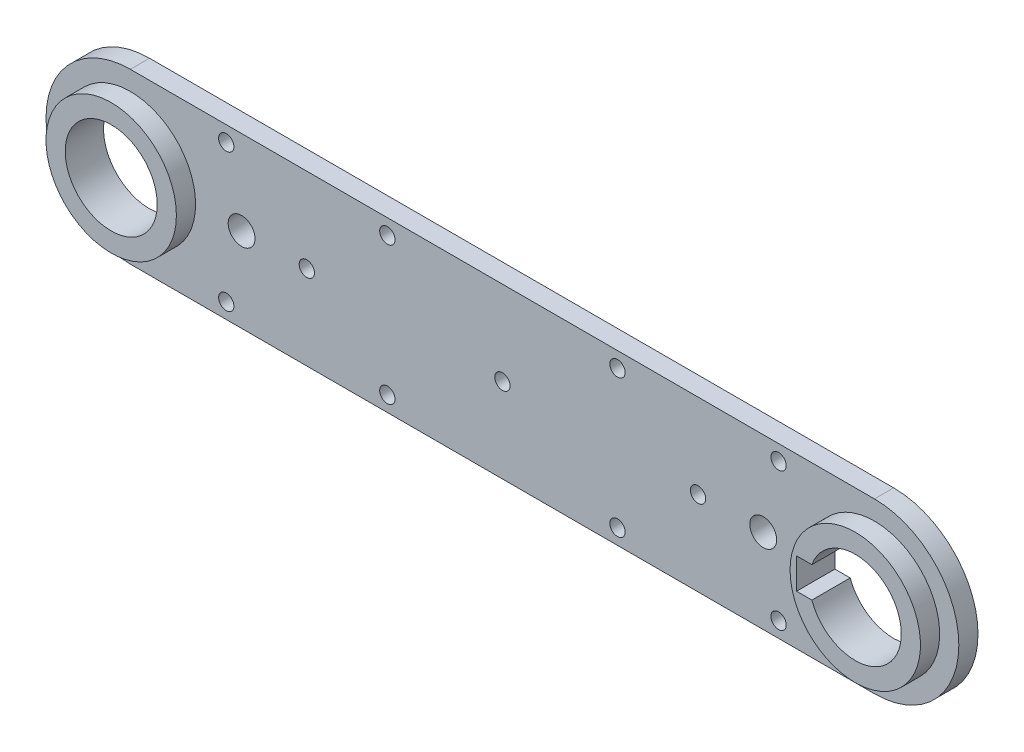
ISO-10303-21;
HEADER;
FILE_DESCRIPTION(('STEP AP214'),'2;1');
FILE_NAME('part.step','',(''),(''),'','','');
FILE_SCHEMA(('AUTOMOTIVE_DESIGN { 1 0 10303 214 1 1 1 1 }'));
ENDSEC;
DATA;
#1=APPLICATION_CONTEXT('core data for automotive mechanical design processes');
#2=APPLICATION_PROTOCOL_DEFINITION('international standard','automotive_design',2000,#1);
#3=PRODUCT_CONTEXT('',#1,'mechanical');
#4=PRODUCT('Part','Part','',(#3));
#5=PRODUCT_RELATED_PRODUCT_CATEGORY('part','',(#4));
#6=PRODUCT_DEFINITION_FORMATION('','',#4);
#7=PRODUCT_DEFINITION_CONTEXT('part definition',#1,'design');
#8=PRODUCT_DEFINITION('design','',#6,#7);
#9=PRODUCT_DEFINITION_SHAPE('','',#8);
#10=(LENGTH_UNIT() NAMED_UNIT(*) SI_UNIT(.MILLI.,.METRE.));
#11=(NAMED_UNIT(*) PLANE_ANGLE_UNIT() SI_UNIT($,.RADIAN.));
#12=(NAMED_UNIT(*) SI_UNIT($,.STERADIAN.) SOLID_ANGLE_UNIT());
#13=UNCERTAINTY_MEASURE_WITH_UNIT(LENGTH_MEASURE(1.E-05),#10,'distance_accuracy_value','');
#14=(GEOMETRIC_REPRESENTATION_CONTEXT(3) GLOBAL_UNCERTAINTY_ASSIGNED_CONTEXT((#13)) GLOBAL_UNIT_ASSIGNED_CONTEXT((#10,
#11,#12)) REPRESENTATION_CONTEXT('',''));
#15=CARTESIAN_POINT('',(0.,0.,0.));
#16=DIRECTION('',(0.,0.,1.));
#17=DIRECTION('',(1.,0.,0.));
#18=AXIS2_PLACEMENT_3D('',#15,#16,#17);
#19=CARTESIAN_POINT('',(0.,22.,5.));
#20=DIRECTION('',(0.,1.,0.));
#21=DIRECTION('',(0.,0.,1.));
#22=AXIS2_PLACEMENT_3D('',#19,#20,#21);
#23=PLANE('',#22);
#24=DIRECTION('',(1.,0.,0.));
#25=VECTOR('',#24,1.);
#26=CARTESIAN_POINT('',(0.,22.,0.));
#27=LINE('',#26,#25);
#28=CARTESIAN_POINT('',(0.,22.,0.));
#29=VERTEX_POINT('',#28);
#30=CARTESIAN_POINT('',(194.,22.,0.));
#31=VERTEX_POINT('',#30);
#32=EDGE_CURVE('E309',#29,#31,#27,.T.);
#33=ORIENTED_EDGE('',*,*,#32,.F.);
#34=DIRECTION('',(0.,0.,-1.));
#35=VECTOR('',#34,1.);
#36=CARTESIAN_POINT('',(0.,22.,5.));
#37=LINE('',#36,#35);
#38=CARTESIAN_POINT('',(0.,22.,5.));
#39=VERTEX_POINT('',#38);
#40=EDGE_CURVE('E321',#39,#29,#37,.T.);
#41=ORIENTED_EDGE('',*,*,#40,.F.);
#42=DIRECTION('',(1.,0.,0.));
#43=VECTOR('',#42,1.);
#44=CARTESIAN_POINT('',(0.,22.,5.));
#45=LINE('',#44,#43);
#46=CARTESIAN_POINT('',(194.,22.,5.));
#47=VERTEX_POINT('',#46);
#48=EDGE_CURVE('E300',#39,#47,#45,.T.);
#49=ORIENTED_EDGE('',*,*,#48,.T.);
#50=DIRECTION('',(0.,0.,-1.));
#51=VECTOR('',#50,1.);
#52=CARTESIAN_POINT('',(194.,22.,5.));
#53=LINE('',#52,#51);
#54=EDGE_CURVE('E119',#47,#31,#53,.T.);
#55=ORIENTED_EDGE('',*,*,#54,.T.);
#56=EDGE_LOOP('',(#33,#41,#49,#55));
#57=FACE_BOUND('',#56,.T.);
#58=ADVANCED_FACE('F71',(#57),#23,.T.);
#59=CARTESIAN_POINT('',(0.,-22.,5.));
#60=DIRECTION('',(0.,1.,0.));
#61=DIRECTION('',(-1.,0.,0.));
#62=AXIS2_PLACEMENT_3D('',#59,#60,#61);
#63=PLANE('',#62);
#64=DIRECTION('',(1.,0.,0.));
#65=VECTOR('',#64,1.);
#66=CARTESIAN_POINT('',(0.,-22.,0.));
#67=LINE('',#66,#65);
#68=CARTESIAN_POINT('',(0.,-22.,0.));
#69=VERTEX_POINT('',#68);
#70=CARTESIAN_POINT('',(194.,-22.,0.));
#71=VERTEX_POINT('',#70);
#72=EDGE_CURVE('E305',#69,#71,#67,.T.);
#73=ORIENTED_EDGE('',*,*,#72,.T.);
#74=DIRECTION('',(0.,0.,-1.));
#75=VECTOR('',#74,1.);
#76=CARTESIAN_POINT('',(194.,-22.,5.));
#77=LINE('',#76,#75);
#78=CARTESIAN_POINT('',(194.,-22.,5.));
#79=VERTEX_POINT('',#78);
#80=EDGE_CURVE('E96',#79,#71,#77,.T.);
#81=ORIENTED_EDGE('',*,*,#80,.F.);
#82=DIRECTION('',(1.,0.,0.));
#83=VECTOR('',#82,1.);
#84=CARTESIAN_POINT('',(0.,-22.,5.));
#85=LINE('',#84,#83);
#86=CARTESIAN_POINT('',(0.,-22.,5.));
#87=VERTEX_POINT('',#86);
#88=EDGE_CURVE('E304',#87,#79,#85,.T.);
#89=ORIENTED_EDGE('',*,*,#88,.F.);
#90=DIRECTION('',(0.,0.,-1.));
#91=VECTOR('',#90,1.);
#92=CARTESIAN_POINT('',(0.,-22.,5.));
#93=LINE('',#92,#91);
#94=EDGE_CURVE('E318',#87,#69,#93,.T.);
#95=ORIENTED_EDGE('',*,*,#94,.T.);
#96=EDGE_LOOP('',(#73,#81,#89,#95));
#97=FACE_BOUND('',#96,.T.);
#98=ADVANCED_FACE('F429',(#97),#63,.F.);
#99=CARTESIAN_POINT('',(0.,0.,0.));
#100=DIRECTION('',(0.,0.,1.));
#101=DIRECTION('',(1.,0.,0.));
#102=AXIS2_PLACEMENT_3D('',#99,#100,#101);
#103=PLANE('',#102);
#104=CARTESIAN_POINT('',(0.,14.,0.));
#105=DIRECTION('',(0.,0.,-1.));
#106=DIRECTION('',(-1.,0.,0.));
#107=AXIS2_PLACEMENT_3D('',#104,#105,#106);
#108=CIRCLE('',#107,1.025);
#109=CARTESIAN_POINT('',(-1.025,14.,0.));
#110=VERTEX_POINT('',#109);
#111=EDGE_CURVE('E164',#110,#110,#108,.T.);
#112=ORIENTED_EDGE('',*,*,#111,.F.);
#113=EDGE_LOOP('',(#112));
#114=FACE_BOUND('',#113,.T.);
#115=CARTESIAN_POINT('',(-14.,0.,0.));
#116=DIRECTION('',(0.,0.,-1.));
#117=DIRECTION('',(-1.,0.,0.));
#118=AXIS2_PLACEMENT_3D('',#115,#116,#117);
#119=CIRCLE('',#118,1.025);
#120=CARTESIAN_POINT('',(-15.025,0.,0.));
#121=VERTEX_POINT('',#120);
#122=EDGE_CURVE('E163',#121,#121,#119,.T.);
#123=ORIENTED_EDGE('',*,*,#122,.F.);
#124=EDGE_LOOP('',(#123));
#125=FACE_BOUND('',#124,.T.);
#126=CARTESIAN_POINT('',(0.,-14.,0.));
#127=DIRECTION('',(0.,0.,-1.));
#128=DIRECTION('',(-1.,0.,0.));
#129=AXIS2_PLACEMENT_3D('',#126,#127,#128);
#130=CIRCLE('',#129,1.025);
#131=CARTESIAN_POINT('',(-1.025,-14.,0.));
#132=VERTEX_POINT('',#131);
#133=EDGE_CURVE('E177',#132,#132,#130,.T.);
#134=ORIENTED_EDGE('',*,*,#133,.F.);
#135=EDGE_LOOP('',(#134));
#136=FACE_BOUND('',#135,.T.);
#137=CARTESIAN_POINT('',(14.,0.,0.));
#138=DIRECTION('',(0.,0.,-1.));
#139=DIRECTION('',(-1.,0.,0.));
#140=AXIS2_PLACEMENT_3D('',#137,#138,#139);
#141=CIRCLE('',#140,1.025);
#142=CARTESIAN_POINT('',(12.975,0.,0.));
#143=VERTEX_POINT('',#142);
#144=EDGE_CURVE('E185',#143,#143,#141,.T.);
#145=ORIENTED_EDGE('',*,*,#144,.F.);
#146=EDGE_LOOP('',(#145));
#147=FACE_BOUND('',#146,.T.);
#148=CARTESIAN_POINT('',(25.,-18.,0.));
#149=DIRECTION('',(0.,0.,-1.));
#150=DIRECTION('',(-1.,0.,0.));
#151=AXIS2_PLACEMENT_3D('',#148,#149,#150);
#152=CIRCLE('',#151,2.);
#153=CARTESIAN_POINT('',(23.,-18.,0.));
#154=VERTEX_POINT('',#153);
#155=EDGE_CURVE('E226',#154,#154,#152,.T.);
#156=ORIENTED_EDGE('',*,*,#155,.F.);
#157=EDGE_LOOP('',(#156));
#158=FACE_BOUND('',#157,.T.);
#159=CARTESIAN_POINT('',(25.,18.,0.));
#160=DIRECTION('',(0.,0.,-1.));
#161=DIRECTION('',(-1.,0.,0.));
#162=AXIS2_PLACEMENT_3D('',#159,#160,#161);
#163=CIRCLE('',#162,2.);
#164=CARTESIAN_POINT('',(23.,18.,0.));
#165=VERTEX_POINT('',#164);
#166=EDGE_CURVE('E247',#165,#165,#163,.T.);
#167=ORIENTED_EDGE('',*,*,#166,.F.);
#168=EDGE_LOOP('',(#167));
#169=FACE_BOUND('',#168,.T.);
#170=CARTESIAN_POINT('',(127.,-18.,0.));
#171=DIRECTION('',(0.,0.,-1.));
#172=DIRECTION('',(-1.,0.,0.));
#173=AXIS2_PLACEMENT_3D('',#170,#171,#172);
#174=CIRCLE('',#173,2.);
#175=CARTESIAN_POINT('',(125.,-18.,0.));
#176=VERTEX_POINT('',#175);
#177=EDGE_CURVE('E243',#176,#176,#174,.T.);
#178=ORIENTED_EDGE('',*,*,#177,.F.);
#179=EDGE_LOOP('',(#178));
#180=FACE_BOUND('',#179,.T.);
#181=CARTESIAN_POINT('',(127.,18.,0.));
#182=DIRECTION('',(0.,0.,-1.));
#183=DIRECTION('',(-1.,0.,0.));
#184=AXIS2_PLACEMENT_3D('',#181,#182,#183);
#185=CIRCLE('',#184,2.);
#186=CARTESIAN_POINT('',(125.,18.,0.));
#187=VERTEX_POINT('',#186);
#188=EDGE_CURVE('E238',#187,#187,#185,.T.);
#189=ORIENTED_EDGE('',*,*,#188,.F.);
#190=EDGE_LOOP('',(#189));
#191=FACE_BOUND('',#190,.T.);
#192=CARTESIAN_POINT('',(169.,-18.,0.));
#193=DIRECTION('',(0.,0.,-1.));
#194=DIRECTION('',(1.,0.,0.));
#195=AXIS2_PLACEMENT_3D('',#192,#193,#194);
#196=CIRCLE('',#195,2.);
#197=CARTESIAN_POINT('',(171.,-18.,0.));
#198=VERTEX_POINT('',#197);
#199=EDGE_CURVE('E242',#198,#198,#196,.T.);
#200=ORIENTED_EDGE('',*,*,#199,.F.);
#201=EDGE_LOOP('',(#200));
#202=FACE_BOUND('',#201,.T.);
#203=CARTESIAN_POINT('',(67.,-18.,0.));
#204=DIRECTION('',(0.,0.,-1.));
#205=DIRECTION('',(1.,0.,0.));
#206=AXIS2_PLACEMENT_3D('',#203,#204,#205);
#207=CIRCLE('',#206,2.);
#208=CARTESIAN_POINT('',(69.,-18.,0.));
#209=VERTEX_POINT('',#208);
#210=EDGE_CURVE('E263',#209,#209,#207,.T.);
#211=ORIENTED_EDGE('',*,*,#210,.F.);
#212=EDGE_LOOP('',(#211));
#213=FACE_BOUND('',#212,.T.);
#214=CARTESIAN_POINT('',(165.,0.,0.));
#215=DIRECTION('',(0.,0.,-1.));
#216=DIRECTION('',(-1.,0.,0.));
#217=AXIS2_PLACEMENT_3D('',#214,#215,#216);
#218=CIRCLE('',#217,3.49999999999999);
#219=CARTESIAN_POINT('',(161.5,0.,0.));
#220=VERTEX_POINT('',#219);
#221=EDGE_CURVE('E259',#220,#220,#218,.T.);
#222=ORIENTED_EDGE('',*,*,#221,.F.);
#223=EDGE_LOOP('',(#222));
#224=FACE_BOUND('',#223,.T.);
#225=CARTESIAN_POINT('',(67.,18.,0.));
#226=DIRECTION('',(0.,0.,-1.));
#227=DIRECTION('',(-1.,0.,0.));
#228=AXIS2_PLACEMENT_3D('',#225,#226,#227);
#229=CIRCLE('',#228,2.);
#230=CARTESIAN_POINT('',(65.,18.,0.));
#231=VERTEX_POINT('',#230);
#232=EDGE_CURVE('E254',#231,#231,#229,.T.);
#233=ORIENTED_EDGE('',*,*,#232,.F.);
#234=EDGE_LOOP('',(#233));
#235=FACE_BOUND('',#234,.T.);
#236=CARTESIAN_POINT('',(148.,0.,0.));
#237=DIRECTION('',(0.,0.,-1.));
#238=DIRECTION('',(-1.,0.,0.));
#239=AXIS2_PLACEMENT_3D('',#236,#237,#238);
#240=CIRCLE('',#239,2.);
#241=CARTESIAN_POINT('',(146.,0.,0.));
#242=VERTEX_POINT('',#241);
#243=EDGE_CURVE('E222',#242,#242,#240,.T.);
#244=ORIENTED_EDGE('',*,*,#243,.F.);
#245=EDGE_LOOP('',(#244));
#246=FACE_BOUND('',#245,.T.);
#247=CARTESIAN_POINT('',(97.,0.,0.));
#248=DIRECTION('',(0.,0.,-1.));
#249=DIRECTION('',(-1.,0.,0.));
#250=AXIS2_PLACEMENT_3D('',#247,#248,#249);
#251=CIRCLE('',#250,2.);
#252=CARTESIAN_POINT('',(95.,0.,0.));
#253=VERTEX_POINT('',#252);
#254=EDGE_CURVE('E227',#253,#253,#251,.T.);
#255=ORIENTED_EDGE('',*,*,#254,.F.);
#256=EDGE_LOOP('',(#255));
#257=FACE_BOUND('',#256,.T.);
#258=CARTESIAN_POINT('',(46.,0.,0.));
#259=DIRECTION('',(0.,0.,-1.));
#260=DIRECTION('',(-1.,0.,0.));
#261=AXIS2_PLACEMENT_3D('',#258,#259,#260);
#262=CIRCLE('',#261,2.);
#263=CARTESIAN_POINT('',(44.,0.,0.));
#264=VERTEX_POINT('',#263);
#265=EDGE_CURVE('E231',#264,#264,#262,.T.);
#266=ORIENTED_EDGE('',*,*,#265,.F.);
#267=EDGE_LOOP('',(#266));
#268=FACE_BOUND('',#267,.T.);
#269=CARTESIAN_POINT('',(29.,0.,0.));
#270=DIRECTION('',(0.,0.,-1.));
#271=DIRECTION('',(1.,0.,0.));
#272=AXIS2_PLACEMENT_3D('',#269,#270,#271);
#273=CIRCLE('',#272,3.50000000000001);
#274=CARTESIAN_POINT('',(32.5,0.,0.));
#275=VERTEX_POINT('',#274);
#276=EDGE_CURVE('E219',#275,#275,#273,.T.);
#277=ORIENTED_EDGE('',*,*,#276,.F.);
#278=EDGE_LOOP('',(#277));
#279=FACE_BOUND('',#278,.T.);
#280=CARTESIAN_POINT('',(169.,18.,0.));
#281=DIRECTION('',(0.,0.,-1.));
#282=DIRECTION('',(-1.,0.,0.));
#283=AXIS2_PLACEMENT_3D('',#280,#281,#282);
#284=CIRCLE('',#283,2.);
#285=CARTESIAN_POINT('',(167.,18.,0.));
#286=VERTEX_POINT('',#285);
#287=EDGE_CURVE('E258',#286,#286,#284,.T.);
#288=ORIENTED_EDGE('',*,*,#287,.F.);
#289=EDGE_LOOP('',(#288));
#290=FACE_BOUND('',#289,.T.);
#291=CARTESIAN_POINT('',(0.,0.,0.));
#292=DIRECTION('',(0.,0.,1.));
#293=DIRECTION('',(1.,0.,0.));
#294=AXIS2_PLACEMENT_3D('',#291,#292,#293);
#295=CIRCLE('',#294,12.);
#296=CARTESIAN_POINT('',(12.,0.,0.));
#297=VERTEX_POINT('',#296);
#298=EDGE_CURVE('E279',#297,#297,#295,.T.);
#299=ORIENTED_EDGE('',*,*,#298,.T.);
#300=EDGE_LOOP('',(#299));
#301=FACE_BOUND('',#300,.T.);
#302=DIRECTION('',(0.,1.,0.));
#303=VECTOR('',#302,1.);
#304=CARTESIAN_POINT('',(178.7,-4.,0.));
#305=LINE('',#304,#303);
#306=CARTESIAN_POINT('',(178.7,-4.,0.));
#307=VERTEX_POINT('',#306);
#308=CARTESIAN_POINT('',(178.7,4.,0.));
#309=VERTEX_POINT('',#308);
#310=EDGE_CURVE('E193',#307,#309,#305,.T.);
#311=ORIENTED_EDGE('',*,*,#310,.F.);
#312=DIRECTION('',(-1.,0.,0.));
#313=VECTOR('',#312,1.);
#314=CARTESIAN_POINT('',(182.7,-4.,0.));
#315=LINE('',#314,#313);
#316=CARTESIAN_POINT('',(182.686291501015,-4.,0.));
#317=VERTEX_POINT('',#316);
#318=EDGE_CURVE('E199',#317,#307,#315,.T.);
#319=ORIENTED_EDGE('',*,*,#318,.F.);
#320=CARTESIAN_POINT('',(194.,0.,0.));
#321=DIRECTION('',(0.,0.,1.));
#322=DIRECTION('',(1.,0.,0.));
#323=AXIS2_PLACEMENT_3D('',#320,#321,#322);
#324=CIRCLE('',#323,12.);
#325=CARTESIAN_POINT('',(182.686291501015,3.99999999999999,0.));
#326=VERTEX_POINT('',#325);
#327=EDGE_CURVE('E338',#317,#326,#324,.T.);
#328=ORIENTED_EDGE('',*,*,#327,.T.);
#329=DIRECTION('',(1.,0.,0.));
#330=VECTOR('',#329,1.);
#331=CARTESIAN_POINT('',(182.7,4.,0.));
#332=LINE('',#331,#330);
#333=EDGE_CURVE('E87',#309,#326,#332,.T.);
#334=ORIENTED_EDGE('',*,*,#333,.F.);
#335=EDGE_LOOP('',(#311,#319,#328,#334));
#336=FACE_BOUND('',#335,.T.);
#337=ORIENTED_EDGE('',*,*,#32,.T.);
#338=CARTESIAN_POINT('',(194.,0.,0.));
#339=DIRECTION('',(0.,0.,1.));
#340=DIRECTION('',(1.,0.,0.));
#341=AXIS2_PLACEMENT_3D('',#338,#339,#340);
#342=CIRCLE('',#341,22.);
#343=EDGE_CURVE('E296',#71,#31,#342,.T.);
#344=ORIENTED_EDGE('',*,*,#343,.F.);
#345=ORIENTED_EDGE('',*,*,#72,.F.);
#346=CARTESIAN_POINT('',(0.,0.,0.));
#347=DIRECTION('',(0.,0.,1.));
#348=DIRECTION('',(1.,0.,0.));
#349=AXIS2_PLACEMENT_3D('',#346,#347,#348);
#350=CIRCLE('',#349,22.);
#351=EDGE_CURVE('E329',#29,#69,#350,.T.);
#352=ORIENTED_EDGE('',*,*,#351,.F.);
#353=EDGE_LOOP('',(#337,#344,#345,#352));
#354=FACE_BOUND('',#353,.T.);
#355=ADVANCED_FACE('F411',(#114,#125,#136,#147,#158,#169,#180,#191,#202,#213,#224,#235,#246,
#257,#268,#279,#290,#301,#336,#354),#103,.F.);
#356=CARTESIAN_POINT('',(0.,0.,5.));
#357=DIRECTION('',(0.,0.,1.));
#358=DIRECTION('',(1.,0.,0.));
#359=AXIS2_PLACEMENT_3D('',#356,#357,#358);
#360=PLANE('',#359);
#361=CARTESIAN_POINT('',(25.,-18.,5.));
#362=DIRECTION('',(0.,0.,1.));
#363=DIRECTION('',(1.,0.,0.));
#364=AXIS2_PLACEMENT_3D('',#361,#362,#363);
#365=CIRCLE('',#364,2.);
#366=CARTESIAN_POINT('',(27.,-18.,5.));
#367=VERTEX_POINT('',#366);
#368=EDGE_CURVE('E342',#367,#367,#365,.T.);
#369=ORIENTED_EDGE('',*,*,#368,.F.);
#370=EDGE_LOOP('',(#369));
#371=FACE_BOUND('',#370,.T.);
#372=CARTESIAN_POINT('',(25.,18.,5.));
#373=DIRECTION('',(0.,0.,1.));
#374=DIRECTION('',(1.,0.,0.));
#375=AXIS2_PLACEMENT_3D('',#372,#373,#374);
#376=CIRCLE('',#375,2.);
#377=CARTESIAN_POINT('',(27.,18.,5.));
#378=VERTEX_POINT('',#377);
#379=EDGE_CURVE('E389',#378,#378,#376,.T.);
#380=ORIENTED_EDGE('',*,*,#379,.F.);
#381=EDGE_LOOP('',(#380));
#382=FACE_BOUND('',#381,.T.);
#383=CARTESIAN_POINT('',(127.,-18.,5.));
#384=DIRECTION('',(0.,0.,1.));
#385=DIRECTION('',(1.,0.,0.));
#386=AXIS2_PLACEMENT_3D('',#383,#384,#385);
#387=CIRCLE('',#386,2.);
#388=CARTESIAN_POINT('',(129.,-18.,5.));
#389=VERTEX_POINT('',#388);
#390=EDGE_CURVE('E385',#389,#389,#387,.T.);
#391=ORIENTED_EDGE('',*,*,#390,.F.);
#392=EDGE_LOOP('',(#391));
#393=FACE_BOUND('',#392,.T.);
#394=CARTESIAN_POINT('',(127.,18.,5.));
#395=DIRECTION('',(0.,0.,1.));
#396=DIRECTION('',(1.,0.,0.));
#397=AXIS2_PLACEMENT_3D('',#394,#395,#396);
#398=CIRCLE('',#397,2.);
#399=CARTESIAN_POINT('',(129.,18.,5.));
#400=VERTEX_POINT('',#399);
#401=EDGE_CURVE('E381',#400,#400,#398,.T.);
#402=ORIENTED_EDGE('',*,*,#401,.F.);
#403=EDGE_LOOP('',(#402));
#404=FACE_BOUND('',#403,.T.);
#405=CARTESIAN_POINT('',(169.,-18.,5.));
#406=DIRECTION('',(0.,0.,1.));
#407=DIRECTION('',(1.,0.,0.));
#408=AXIS2_PLACEMENT_3D('',#405,#406,#407);
#409=CIRCLE('',#408,2.);
#410=CARTESIAN_POINT('',(171.,-18.,5.));
#411=VERTEX_POINT('',#410);
#412=EDGE_CURVE('E377',#411,#411,#409,.T.);
#413=ORIENTED_EDGE('',*,*,#412,.F.);
#414=EDGE_LOOP('',(#413));
#415=FACE_BOUND('',#414,.T.);
#416=CARTESIAN_POINT('',(67.,-18.,5.));
#417=DIRECTION('',(0.,0.,1.));
#418=DIRECTION('',(1.,0.,0.));
#419=AXIS2_PLACEMENT_3D('',#416,#417,#418);
#420=CIRCLE('',#419,2.);
#421=CARTESIAN_POINT('',(69.,-18.,5.));
#422=VERTEX_POINT('',#421);
#423=EDGE_CURVE('E373',#422,#422,#420,.T.);
#424=ORIENTED_EDGE('',*,*,#423,.F.);
#425=EDGE_LOOP('',(#424));
#426=FACE_BOUND('',#425,.T.);
#427=CARTESIAN_POINT('',(165.,0.,5.));
#428=DIRECTION('',(0.,0.,1.));
#429=DIRECTION('',(1.,0.,0.));
#430=AXIS2_PLACEMENT_3D('',#427,#428,#429);
#431=CIRCLE('',#430,3.49999999999999);
#432=CARTESIAN_POINT('',(168.5,0.,5.));
#433=VERTEX_POINT('',#432);
#434=EDGE_CURVE('E369',#433,#433,#431,.T.);
#435=ORIENTED_EDGE('',*,*,#434,.F.);
#436=EDGE_LOOP('',(#435));
#437=FACE_BOUND('',#436,.T.);
#438=CARTESIAN_POINT('',(67.,18.,5.));
#439=DIRECTION('',(0.,0.,1.));
#440=DIRECTION('',(1.,0.,0.));
#441=AXIS2_PLACEMENT_3D('',#438,#439,#440);
#442=CIRCLE('',#441,2.);
#443=CARTESIAN_POINT('',(69.,18.,5.));
#444=VERTEX_POINT('',#443);
#445=EDGE_CURVE('E365',#444,#444,#442,.T.);
#446=ORIENTED_EDGE('',*,*,#445,.F.);
#447=EDGE_LOOP('',(#446));
#448=FACE_BOUND('',#447,.T.);
#449=CARTESIAN_POINT('',(148.,0.,5.));
#450=DIRECTION('',(0.,0.,1.));
#451=DIRECTION('',(1.,0.,0.));
#452=AXIS2_PLACEMENT_3D('',#449,#450,#451);
#453=CIRCLE('',#452,2.);
#454=CARTESIAN_POINT('',(150.,0.,5.));
#455=VERTEX_POINT('',#454);
#456=EDGE_CURVE('E361',#455,#455,#453,.T.);
#457=ORIENTED_EDGE('',*,*,#456,.F.);
#458=EDGE_LOOP('',(#457));
#459=FACE_BOUND('',#458,.T.);
#460=CARTESIAN_POINT('',(97.,0.,5.));
#461=DIRECTION('',(0.,0.,1.));
#462=DIRECTION('',(1.,0.,0.));
#463=AXIS2_PLACEMENT_3D('',#460,#461,#462);
#464=CIRCLE('',#463,2.);
#465=CARTESIAN_POINT('',(99.,0.,5.));
#466=VERTEX_POINT('',#465);
#467=EDGE_CURVE('E357',#466,#466,#464,.T.);
#468=ORIENTED_EDGE('',*,*,#467,.F.);
#469=EDGE_LOOP('',(#468));
#470=FACE_BOUND('',#469,.T.);
#471=CARTESIAN_POINT('',(46.,0.,5.));
#472=DIRECTION('',(0.,0.,1.));
#473=DIRECTION('',(1.,0.,0.));
#474=AXIS2_PLACEMENT_3D('',#471,#472,#473);
#475=CIRCLE('',#474,2.);
#476=CARTESIAN_POINT('',(48.,0.,5.));
#477=VERTEX_POINT('',#476);
#478=EDGE_CURVE('E353',#477,#477,#475,.T.);
#479=ORIENTED_EDGE('',*,*,#478,.F.);
#480=EDGE_LOOP('',(#479));
#481=FACE_BOUND('',#480,.T.);
#482=CARTESIAN_POINT('',(29.,0.,5.));
#483=DIRECTION('',(0.,0.,1.));
#484=DIRECTION('',(1.,0.,0.));
#485=AXIS2_PLACEMENT_3D('',#482,#483,#484);
#486=CIRCLE('',#485,3.50000000000001);
#487=CARTESIAN_POINT('',(32.5,0.,5.));
#488=VERTEX_POINT('',#487);
#489=EDGE_CURVE('E349',#488,#488,#486,.T.);
#490=ORIENTED_EDGE('',*,*,#489,.F.);
#491=EDGE_LOOP('',(#490));
#492=FACE_BOUND('',#491,.T.);
#493=CARTESIAN_POINT('',(169.,18.,5.));
#494=DIRECTION('',(0.,0.,1.));
#495=DIRECTION('',(1.,0.,0.));
#496=AXIS2_PLACEMENT_3D('',#493,#494,#495);
#497=CIRCLE('',#496,2.);
#498=CARTESIAN_POINT('',(171.,18.,5.));
#499=VERTEX_POINT('',#498);
#500=EDGE_CURVE('E273',#499,#499,#497,.T.);
#501=ORIENTED_EDGE('',*,*,#500,.F.);
#502=EDGE_LOOP('',(#501));
#503=FACE_BOUND('',#502,.T.);
#504=CARTESIAN_POINT('',(194.,0.,5.));
#505=DIRECTION('',(0.,0.,1.));
#506=DIRECTION('',(-1.,0.,0.));
#507=AXIS2_PLACEMENT_3D('',#504,#505,#506);
#508=CIRCLE('',#507,17.);
#509=CARTESIAN_POINT('',(177.,0.,5.));
#510=VERTEX_POINT('',#509);
#511=EDGE_CURVE('E278',#510,#510,#508,.T.);
#512=ORIENTED_EDGE('',*,*,#511,.F.);
#513=EDGE_LOOP('',(#512));
#514=FACE_BOUND('',#513,.T.);
#515=CARTESIAN_POINT('',(0.,0.,5.));
#516=DIRECTION('',(0.,0.,1.));
#517=DIRECTION('',(1.,0.,0.));
#518=AXIS2_PLACEMENT_3D('',#515,#516,#517);
#519=CIRCLE('',#518,17.);
#520=CARTESIAN_POINT('',(17.,0.,5.));
#521=VERTEX_POINT('',#520);
#522=EDGE_CURVE('E291',#521,#521,#519,.T.);
#523=ORIENTED_EDGE('',*,*,#522,.F.);
#524=EDGE_LOOP('',(#523));
#525=FACE_BOUND('',#524,.T.);
#526=ORIENTED_EDGE('',*,*,#88,.T.);
#527=CARTESIAN_POINT('',(194.,0.,5.));
#528=DIRECTION('',(0.,0.,1.));
#529=DIRECTION('',(1.,0.,0.));
#530=AXIS2_PLACEMENT_3D('',#527,#528,#529);
#531=CIRCLE('',#530,22.);
#532=EDGE_CURVE('E333',#79,#47,#531,.T.);
#533=ORIENTED_EDGE('',*,*,#532,.T.);
#534=ORIENTED_EDGE('',*,*,#48,.F.);
#535=CARTESIAN_POINT('',(0.,0.,5.));
#536=DIRECTION('',(0.,0.,1.));
#537=DIRECTION('',(1.,0.,0.));
#538=AXIS2_PLACEMENT_3D('',#535,#536,#537);
#539=CIRCLE('',#538,22.);
#540=EDGE_CURVE('E313',#39,#87,#539,.T.);
#541=ORIENTED_EDGE('',*,*,#540,.T.);
#542=EDGE_LOOP('',(#526,#533,#534,#541));
#543=FACE_BOUND('',#542,.T.);
#544=ADVANCED_FACE('F449',(#371,#382,#393,#404,#415,#426,#437,#448,#459,#470,#481,#492,#503,
#514,#525,#543),#360,.T.);
#545=CARTESIAN_POINT('',(194.,0.,5.));
#546=DIRECTION('',(0.,0.,-1.));
#547=DIRECTION('',(-1.,0.,0.));
#548=AXIS2_PLACEMENT_3D('',#545,#546,#547);
#549=CYLINDRICAL_SURFACE('',#548,22.);
#550=ORIENTED_EDGE('',*,*,#343,.T.);
#551=ORIENTED_EDGE('',*,*,#54,.F.);
#552=ORIENTED_EDGE('',*,*,#532,.F.);
#553=ORIENTED_EDGE('',*,*,#80,.T.);
#554=EDGE_LOOP('',(#550,#551,#552,#553));
#555=FACE_BOUND('',#554,.T.);
#556=ADVANCED_FACE('F73',(#555),#549,.T.);
#557=CARTESIAN_POINT('',(0.,0.,5.));
#558=DIRECTION('',(0.,0.,-1.));
#559=DIRECTION('',(-1.,0.,0.));
#560=AXIS2_PLACEMENT_3D('',#557,#558,#559);
#561=CYLINDRICAL_SURFACE('',#560,22.);
#562=ORIENTED_EDGE('',*,*,#540,.F.);
#563=ORIENTED_EDGE('',*,*,#40,.T.);
#564=ORIENTED_EDGE('',*,*,#351,.T.);
#565=ORIENTED_EDGE('',*,*,#94,.F.);
#566=EDGE_LOOP('',(#562,#563,#564,#565));
#567=FACE_BOUND('',#566,.T.);
#568=ADVANCED_FACE('F438',(#567),#561,.T.);
#569=CARTESIAN_POINT('',(0.,0.,10.));
#570=DIRECTION('',(0.,0.,1.));
#571=DIRECTION('',(1.,0.,0.));
#572=AXIS2_PLACEMENT_3D('',#569,#570,#571);
#573=PLANE('',#572);
#574=CARTESIAN_POINT('',(0.,0.,10.));
#575=DIRECTION('',(0.,0.,1.));
#576=DIRECTION('',(1.,0.,0.));
#577=AXIS2_PLACEMENT_3D('',#574,#575,#576);
#578=CIRCLE('',#577,17.);
#579=CARTESIAN_POINT('',(17.,0.,10.));
#580=VERTEX_POINT('',#579);
#581=EDGE_CURVE('E292',#580,#580,#578,.T.);
#582=ORIENTED_EDGE('',*,*,#581,.T.);
#583=EDGE_LOOP('',(#582));
#584=FACE_BOUND('',#583,.T.);
#585=CARTESIAN_POINT('',(0.,0.,10.));
#586=DIRECTION('',(0.,0.,1.));
#587=DIRECTION('',(1.,0.,0.));
#588=AXIS2_PLACEMENT_3D('',#585,#586,#587);
#589=CIRCLE('',#588,12.);
#590=CARTESIAN_POINT('',(12.,0.,10.));
#591=VERTEX_POINT('',#590);
#592=EDGE_CURVE('E284',#591,#591,#589,.T.);
#593=ORIENTED_EDGE('',*,*,#592,.F.);
#594=EDGE_LOOP('',(#593));
#595=FACE_BOUND('',#594,.T.);
#596=ADVANCED_FACE('F440',(#584,#595),#573,.T.);
#597=CARTESIAN_POINT('',(0.,0.,10.));
#598=DIRECTION('',(0.,0.,-1.));
#599=DIRECTION('',(-1.,0.,0.));
#600=AXIS2_PLACEMENT_3D('',#597,#598,#599);
#601=CYLINDRICAL_SURFACE('',#600,17.);
#602=ORIENTED_EDGE('',*,*,#581,.F.);
#603=EDGE_LOOP('',(#602));
#604=FACE_BOUND('',#603,.T.);
#605=ORIENTED_EDGE('',*,*,#522,.T.);
#606=EDGE_LOOP('',(#605));
#607=FACE_BOUND('',#606,.T.);
#608=ADVANCED_FACE('F446',(#604,#607),#601,.T.);
#609=CARTESIAN_POINT('',(0.,0.,10.));
#610=DIRECTION('',(0.,0.,-1.));
#611=DIRECTION('',(-1.,0.,0.));
#612=AXIS2_PLACEMENT_3D('',#609,#610,#611);
#613=CYLINDRICAL_SURFACE('',#612,12.);
#614=ORIENTED_EDGE('',*,*,#592,.T.);
#615=EDGE_LOOP('',(#614));
#616=FACE_BOUND('',#615,.T.);
#617=ORIENTED_EDGE('',*,*,#298,.F.);
#618=EDGE_LOOP('',(#617));
#619=FACE_BOUND('',#618,.T.);
#620=ADVANCED_FACE('F466',(#616,#619),#613,.F.);
#621=CARTESIAN_POINT('',(194.,0.,10.));
#622=DIRECTION('',(0.,0.,-1.));
#623=DIRECTION('',(-1.,0.,0.));
#624=AXIS2_PLACEMENT_3D('',#621,#622,#623);
#625=PLANE('',#624);
#626=CARTESIAN_POINT('',(194.,0.,10.));
#627=DIRECTION('',(0.,0.,1.));
#628=DIRECTION('',(-1.,0.,0.));
#629=AXIS2_PLACEMENT_3D('',#626,#627,#628);
#630=CIRCLE('',#629,17.);
#631=CARTESIAN_POINT('',(177.,0.,10.));
#632=VERTEX_POINT('',#631);
#633=EDGE_CURVE('E280',#632,#632,#630,.T.);
#634=ORIENTED_EDGE('',*,*,#633,.T.);
#635=EDGE_LOOP('',(#634));
#636=FACE_BOUND('',#635,.T.);
#637=CARTESIAN_POINT('',(194.,0.,10.));
#638=DIRECTION('',(0.,0.,1.));
#639=DIRECTION('',(-1.,0.,0.));
#640=AXIS2_PLACEMENT_3D('',#637,#638,#639);
#641=CIRCLE('',#640,12.);
#642=CARTESIAN_POINT('',(182.686291501015,-4.,10.));
#643=VERTEX_POINT('',#642);
#644=CARTESIAN_POINT('',(182.686291501015,4.,10.));
#645=VERTEX_POINT('',#644);
#646=EDGE_CURVE('E274',#643,#645,#641,.T.);
#647=ORIENTED_EDGE('',*,*,#646,.F.);
#648=DIRECTION('',(-1.,0.,0.));
#649=VECTOR('',#648,1.);
#650=CARTESIAN_POINT('',(182.7,-4.,10.));
#651=LINE('',#650,#649);
#652=CARTESIAN_POINT('',(178.7,-4.,10.));
#653=VERTEX_POINT('',#652);
#654=EDGE_CURVE('E203',#643,#653,#651,.T.);
#655=ORIENTED_EDGE('',*,*,#654,.T.);
#656=DIRECTION('',(0.,1.,0.));
#657=VECTOR('',#656,1.);
#658=CARTESIAN_POINT('',(178.7,-4.,10.));
#659=LINE('',#658,#657);
#660=CARTESIAN_POINT('',(178.7,4.,10.));
#661=VERTEX_POINT('',#660);
#662=EDGE_CURVE('E194',#653,#661,#659,.T.);
#663=ORIENTED_EDGE('',*,*,#662,.T.);
#664=DIRECTION('',(1.,0.,0.));
#665=VECTOR('',#664,1.);
#666=CARTESIAN_POINT('',(182.7,4.,10.));
#667=LINE('',#666,#665);
#668=EDGE_CURVE('E198',#661,#645,#667,.T.);
#669=ORIENTED_EDGE('',*,*,#668,.T.);
#670=EDGE_LOOP('',(#647,#655,#663,#669));
#671=FACE_BOUND('',#670,.T.);
#672=ADVANCED_FACE('F402',(#636,#671),#625,.F.);
#673=CARTESIAN_POINT('',(194.,0.,10.));
#674=DIRECTION('',(0.,0.,-1.));
#675=DIRECTION('',(-1.,0.,0.));
#676=AXIS2_PLACEMENT_3D('',#673,#674,#675);
#677=CYLINDRICAL_SURFACE('',#676,17.);
#678=ORIENTED_EDGE('',*,*,#633,.F.);
#679=EDGE_LOOP('',(#678));
#680=FACE_BOUND('',#679,.T.);
#681=ORIENTED_EDGE('',*,*,#511,.T.);
#682=EDGE_LOOP('',(#681));
#683=FACE_BOUND('',#682,.T.);
#684=ADVANCED_FACE('F472',(#680,#683),#677,.T.);
#685=CARTESIAN_POINT('',(194.,0.,10.));
#686=DIRECTION('',(0.,0.,-1.));
#687=DIRECTION('',(-1.,0.,0.));
#688=AXIS2_PLACEMENT_3D('',#685,#686,#687);
#689=CYLINDRICAL_SURFACE('',#688,12.);
#690=DIRECTION('',(0.,0.,-1.));
#691=VECTOR('',#690,1.);
#692=CARTESIAN_POINT('',(182.686291501015,-4.,10.));
#693=LINE('',#692,#691);
#694=EDGE_CURVE('E12',#643,#317,#693,.T.);
#695=ORIENTED_EDGE('',*,*,#694,.F.);
#696=ORIENTED_EDGE('',*,*,#646,.T.);
#697=DIRECTION('',(0.,0.,-1.));
#698=VECTOR('',#697,1.);
#699=CARTESIAN_POINT('',(182.686291501015,4.,10.));
#700=LINE('',#699,#698);
#701=EDGE_CURVE('E80',#326,#645,#700,.F.);
#702=ORIENTED_EDGE('',*,*,#701,.F.);
#703=ORIENTED_EDGE('',*,*,#327,.F.);
#704=EDGE_LOOP('',(#695,#696,#702,#703));
#705=FACE_BOUND('',#704,.T.);
#706=ADVANCED_FACE('F405',(#705),#689,.F.);
#707=CARTESIAN_POINT('',(169.,18.,10.));
#708=DIRECTION('',(0.,0.,-1.));
#709=DIRECTION('',(-1.,0.,0.));
#710=AXIS2_PLACEMENT_3D('',#707,#708,#709);
#711=CYLINDRICAL_SURFACE('',#710,2.);
#712=ORIENTED_EDGE('',*,*,#500,.T.);
#713=EDGE_LOOP('',(#712));
#714=FACE_BOUND('',#713,.T.);
#715=ORIENTED_EDGE('',*,*,#287,.T.);
#716=EDGE_LOOP('',(#715));
#717=FACE_BOUND('',#716,.T.);
#718=ADVANCED_FACE('F481',(#714,#717),#711,.F.);
#719=CARTESIAN_POINT('',(29.,0.,10.));
#720=DIRECTION('',(0.,0.,-1.));
#721=DIRECTION('',(-1.,0.,0.));
#722=AXIS2_PLACEMENT_3D('',#719,#720,#721);
#723=CYLINDRICAL_SURFACE('',#722,3.50000000000001);
#724=ORIENTED_EDGE('',*,*,#489,.T.);
#725=EDGE_LOOP('',(#724));
#726=FACE_BOUND('',#725,.T.);
#727=ORIENTED_EDGE('',*,*,#276,.T.);
#728=EDGE_LOOP('',(#727));
#729=FACE_BOUND('',#728,.T.);
#730=ADVANCED_FACE('F484',(#726,#729),#723,.F.);
#731=CARTESIAN_POINT('',(46.,0.,10.));
#732=DIRECTION('',(0.,0.,-1.));
#733=DIRECTION('',(-1.,0.,0.));
#734=AXIS2_PLACEMENT_3D('',#731,#732,#733);
#735=CYLINDRICAL_SURFACE('',#734,2.);
#736=ORIENTED_EDGE('',*,*,#478,.T.);
#737=EDGE_LOOP('',(#736));
#738=FACE_BOUND('',#737,.T.);
#739=ORIENTED_EDGE('',*,*,#265,.T.);
#740=EDGE_LOOP('',(#739));
#741=FACE_BOUND('',#740,.T.);
#742=ADVANCED_FACE('F516',(#738,#741),#735,.F.);
#743=CARTESIAN_POINT('',(97.,0.,10.));
#744=DIRECTION('',(0.,0.,-1.));
#745=DIRECTION('',(-1.,0.,0.));
#746=AXIS2_PLACEMENT_3D('',#743,#744,#745);
#747=CYLINDRICAL_SURFACE('',#746,2.);
#748=ORIENTED_EDGE('',*,*,#467,.T.);
#749=EDGE_LOOP('',(#748));
#750=FACE_BOUND('',#749,.T.);
#751=ORIENTED_EDGE('',*,*,#254,.T.);
#752=EDGE_LOOP('',(#751));
#753=FACE_BOUND('',#752,.T.);
#754=ADVANCED_FACE('F520',(#750,#753),#747,.F.);
#755=CARTESIAN_POINT('',(148.,0.,10.));
#756=DIRECTION('',(0.,0.,-1.));
#757=DIRECTION('',(-1.,0.,0.));
#758=AXIS2_PLACEMENT_3D('',#755,#756,#757);
#759=CYLINDRICAL_SURFACE('',#758,2.);
#760=ORIENTED_EDGE('',*,*,#456,.T.);
#761=EDGE_LOOP('',(#760));
#762=FACE_BOUND('',#761,.T.);
#763=ORIENTED_EDGE('',*,*,#243,.T.);
#764=EDGE_LOOP('',(#763));
#765=FACE_BOUND('',#764,.T.);
#766=ADVANCED_FACE('F501',(#762,#765),#759,.F.);
#767=CARTESIAN_POINT('',(67.,18.,10.));
#768=DIRECTION('',(0.,0.,-1.));
#769=DIRECTION('',(-1.,0.,0.));
#770=AXIS2_PLACEMENT_3D('',#767,#768,#769);
#771=CYLINDRICAL_SURFACE('',#770,2.);
#772=ORIENTED_EDGE('',*,*,#445,.T.);
#773=EDGE_LOOP('',(#772));
#774=FACE_BOUND('',#773,.T.);
#775=ORIENTED_EDGE('',*,*,#232,.T.);
#776=EDGE_LOOP('',(#775));
#777=FACE_BOUND('',#776,.T.);
#778=ADVANCED_FACE('F498',(#774,#777),#771,.F.);
#779=CARTESIAN_POINT('',(165.,0.,10.));
#780=DIRECTION('',(0.,0.,-1.));
#781=DIRECTION('',(-1.,0.,0.));
#782=AXIS2_PLACEMENT_3D('',#779,#780,#781);
#783=CYLINDRICAL_SURFACE('',#782,3.49999999999999);
#784=ORIENTED_EDGE('',*,*,#434,.T.);
#785=EDGE_LOOP('',(#784));
#786=FACE_BOUND('',#785,.T.);
#787=ORIENTED_EDGE('',*,*,#221,.T.);
#788=EDGE_LOOP('',(#787));
#789=FACE_BOUND('',#788,.T.);
#790=ADVANCED_FACE('F494',(#786,#789),#783,.F.);
#791=CARTESIAN_POINT('',(67.,-18.,10.));
#792=DIRECTION('',(0.,0.,-1.));
#793=DIRECTION('',(-1.,0.,0.));
#794=AXIS2_PLACEMENT_3D('',#791,#792,#793);
#795=CYLINDRICAL_SURFACE('',#794,2.);
#796=ORIENTED_EDGE('',*,*,#423,.T.);
#797=EDGE_LOOP('',(#796));
#798=FACE_BOUND('',#797,.T.);
#799=ORIENTED_EDGE('',*,*,#210,.T.);
#800=EDGE_LOOP('',(#799));
#801=FACE_BOUND('',#800,.T.);
#802=ADVANCED_FACE('F490',(#798,#801),#795,.F.);
#803=CARTESIAN_POINT('',(169.,-18.,10.));
#804=DIRECTION('',(0.,0.,-1.));
#805=DIRECTION('',(-1.,0.,0.));
#806=AXIS2_PLACEMENT_3D('',#803,#804,#805);
#807=CYLINDRICAL_SURFACE('',#806,2.);
#808=ORIENTED_EDGE('',*,*,#412,.T.);
#809=EDGE_LOOP('',(#808));
#810=FACE_BOUND('',#809,.T.);
#811=ORIENTED_EDGE('',*,*,#199,.T.);
#812=EDGE_LOOP('',(#811));
#813=FACE_BOUND('',#812,.T.);
#814=ADVANCED_FACE('F486',(#810,#813),#807,.F.);
#815=CARTESIAN_POINT('',(127.,18.,10.));
#816=DIRECTION('',(0.,0.,-1.));
#817=DIRECTION('',(-1.,0.,0.));
#818=AXIS2_PLACEMENT_3D('',#815,#816,#817);
#819=CYLINDRICAL_SURFACE('',#818,2.);
#820=ORIENTED_EDGE('',*,*,#401,.T.);
#821=EDGE_LOOP('',(#820));
#822=FACE_BOUND('',#821,.T.);
#823=ORIENTED_EDGE('',*,*,#188,.T.);
#824=EDGE_LOOP('',(#823));
#825=FACE_BOUND('',#824,.T.);
#826=ADVANCED_FACE('F489',(#822,#825),#819,.F.);
#827=CARTESIAN_POINT('',(127.,-18.,10.));
#828=DIRECTION('',(0.,0.,-1.));
#829=DIRECTION('',(-1.,0.,0.));
#830=AXIS2_PLACEMENT_3D('',#827,#828,#829);
#831=CYLINDRICAL_SURFACE('',#830,2.);
#832=ORIENTED_EDGE('',*,*,#390,.T.);
#833=EDGE_LOOP('',(#832));
#834=FACE_BOUND('',#833,.T.);
#835=ORIENTED_EDGE('',*,*,#177,.T.);
#836=EDGE_LOOP('',(#835));
#837=FACE_BOUND('',#836,.T.);
#838=ADVANCED_FACE('F506',(#834,#837),#831,.F.);
#839=CARTESIAN_POINT('',(25.,18.,10.));
#840=DIRECTION('',(0.,0.,-1.));
#841=DIRECTION('',(-1.,0.,0.));
#842=AXIS2_PLACEMENT_3D('',#839,#840,#841);
#843=CYLINDRICAL_SURFACE('',#842,2.);
#844=ORIENTED_EDGE('',*,*,#379,.T.);
#845=EDGE_LOOP('',(#844));
#846=FACE_BOUND('',#845,.T.);
#847=ORIENTED_EDGE('',*,*,#166,.T.);
#848=EDGE_LOOP('',(#847));
#849=FACE_BOUND('',#848,.T.);
#850=ADVANCED_FACE('F423',(#846,#849),#843,.F.);
#851=CARTESIAN_POINT('',(25.,-18.,10.));
#852=DIRECTION('',(0.,0.,-1.));
#853=DIRECTION('',(-1.,0.,0.));
#854=AXIS2_PLACEMENT_3D('',#851,#852,#853);
#855=CYLINDRICAL_SURFACE('',#854,2.);
#856=ORIENTED_EDGE('',*,*,#368,.T.);
#857=EDGE_LOOP('',(#856));
#858=FACE_BOUND('',#857,.T.);
#859=ORIENTED_EDGE('',*,*,#155,.T.);
#860=EDGE_LOOP('',(#859));
#861=FACE_BOUND('',#860,.T.);
#862=ADVANCED_FACE('F416',(#858,#861),#855,.F.);
#863=CARTESIAN_POINT('',(178.7,-4.,10.));
#864=DIRECTION('',(-1.,0.,0.));
#865=DIRECTION('',(0.,0.,1.));
#866=AXIS2_PLACEMENT_3D('',#863,#864,#865);
#867=PLANE('',#866);
#868=ORIENTED_EDGE('',*,*,#310,.T.);
#869=DIRECTION('',(0.,0.,-1.));
#870=VECTOR('',#869,1.);
#871=CARTESIAN_POINT('',(178.7,4.,10.));
#872=LINE('',#871,#870);
#873=EDGE_CURVE('E207',#661,#309,#872,.T.);
#874=ORIENTED_EDGE('',*,*,#873,.F.);
#875=ORIENTED_EDGE('',*,*,#662,.F.);
#876=DIRECTION('',(0.,0.,-1.));
#877=VECTOR('',#876,1.);
#878=CARTESIAN_POINT('',(178.7,-4.,10.));
#879=LINE('',#878,#877);
#880=EDGE_CURVE('E215',#653,#307,#879,.T.);
#881=ORIENTED_EDGE('',*,*,#880,.T.);
#882=EDGE_LOOP('',(#868,#874,#875,#881));
#883=FACE_BOUND('',#882,.T.);
#884=ADVANCED_FACE('F414',(#883),#867,.F.);
#885=CARTESIAN_POINT('',(182.7,-4.,10.));
#886=DIRECTION('',(0.,-1.,0.));
#887=DIRECTION('',(0.,0.,-1.));
#888=AXIS2_PLACEMENT_3D('',#885,#886,#887);
#889=PLANE('',#888);
#890=ORIENTED_EDGE('',*,*,#694,.T.);
#891=ORIENTED_EDGE('',*,*,#318,.T.);
#892=ORIENTED_EDGE('',*,*,#880,.F.);
#893=ORIENTED_EDGE('',*,*,#654,.F.);
#894=EDGE_LOOP('',(#890,#891,#892,#893));
#895=FACE_BOUND('',#894,.T.);
#896=ADVANCED_FACE('F408',(#895),#889,.F.);
#897=CARTESIAN_POINT('',(182.7,4.,10.));
#898=DIRECTION('',(0.,1.,0.));
#899=DIRECTION('',(0.,0.,1.));
#900=AXIS2_PLACEMENT_3D('',#897,#898,#899);
#901=PLANE('',#900);
#902=ORIENTED_EDGE('',*,*,#701,.T.);
#903=ORIENTED_EDGE('',*,*,#668,.F.);
#904=ORIENTED_EDGE('',*,*,#873,.T.);
#905=ORIENTED_EDGE('',*,*,#333,.T.);
#906=EDGE_LOOP('',(#902,#903,#904,#905));
#907=FACE_BOUND('',#906,.T.);
#908=ADVANCED_FACE('F397',(#907),#901,.F.);
#909=CARTESIAN_POINT('',(14.,0.,5.73411786549675));
#910=DIRECTION('',(0.,0.,-1.));
#911=DIRECTION('',(-1.,0.,0.));
#912=AXIS2_PLACEMENT_3D('',#909,#910,#911);
#913=CONICAL_SURFACE('',#912,1.025,1.02974425867665);
#914=CARTESIAN_POINT('',(14.,0.,6.35));
#915=VERTEX_POINT('',#914);
#916=VERTEX_LOOP('',#915);
#917=FACE_BOUND('',#916,.T.);
#918=CARTESIAN_POINT('',(14.,0.,5.73411786549675));
#919=DIRECTION('',(0.,0.,-1.));
#920=DIRECTION('',(-1.,0.,0.));
#921=AXIS2_PLACEMENT_3D('',#918,#919,#920);
#922=CIRCLE('',#921,1.025);
#923=CARTESIAN_POINT('',(12.975,0.,5.73411786549675));
#924=VERTEX_POINT('',#923);
#925=EDGE_CURVE('E189',#924,#924,#922,.T.);
#926=ORIENTED_EDGE('',*,*,#925,.T.);
#927=EDGE_LOOP('',(#926));
#928=FACE_BOUND('',#927,.T.);
#929=ADVANCED_FACE('F631',(#917,#928),#913,.F.);
#930=CARTESIAN_POINT('',(14.,0.,0.));
#931=DIRECTION('',(0.,0.,-1.));
#932=DIRECTION('',(-1.,0.,0.));
#933=AXIS2_PLACEMENT_3D('',#930,#931,#932);
#934=CYLINDRICAL_SURFACE('',#933,1.025);
#935=ORIENTED_EDGE('',*,*,#925,.F.);
#936=EDGE_LOOP('',(#935));
#937=FACE_BOUND('',#936,.T.);
#938=ORIENTED_EDGE('',*,*,#144,.T.);
#939=EDGE_LOOP('',(#938));
#940=FACE_BOUND('',#939,.T.);
#941=ADVANCED_FACE('F646',(#937,#940),#934,.F.);
#942=CARTESIAN_POINT('',(0.,-14.,5.73411786549675));
#943=DIRECTION('',(0.,0.,-1.));
#944=DIRECTION('',(-1.,0.,0.));
#945=AXIS2_PLACEMENT_3D('',#942,#943,#944);
#946=CONICAL_SURFACE('',#945,1.025,1.02974425867665);
#947=CARTESIAN_POINT('',(0.,-14.,6.35));
#948=VERTEX_POINT('',#947);
#949=VERTEX_LOOP('',#948);
#950=FACE_BOUND('',#949,.T.);
#951=CARTESIAN_POINT('',(0.,-14.,5.73411786549675));
#952=DIRECTION('',(0.,0.,-1.));
#953=DIRECTION('',(-1.,0.,0.));
#954=AXIS2_PLACEMENT_3D('',#951,#952,#953);
#955=CIRCLE('',#954,1.025);
#956=CARTESIAN_POINT('',(-1.025,-14.,5.73411786549675));
#957=VERTEX_POINT('',#956);
#958=EDGE_CURVE('E181',#957,#957,#955,.T.);
#959=ORIENTED_EDGE('',*,*,#958,.T.);
#960=EDGE_LOOP('',(#959));
#961=FACE_BOUND('',#960,.T.);
#962=ADVANCED_FACE('F656',(#950,#961),#946,.F.);
#963=CARTESIAN_POINT('',(0.,-14.,0.));
#964=DIRECTION('',(0.,0.,-1.));
#965=DIRECTION('',(-1.,0.,0.));
#966=AXIS2_PLACEMENT_3D('',#963,#964,#965);
#967=CYLINDRICAL_SURFACE('',#966,1.025);
#968=ORIENTED_EDGE('',*,*,#958,.F.);
#969=EDGE_LOOP('',(#968));
#970=FACE_BOUND('',#969,.T.);
#971=ORIENTED_EDGE('',*,*,#133,.T.);
#972=EDGE_LOOP('',(#971));
#973=FACE_BOUND('',#972,.T.);
#974=ADVANCED_FACE('F666',(#970,#973),#967,.F.);
#975=CARTESIAN_POINT('',(-14.,0.,5.73411786549675));
#976=DIRECTION('',(0.,0.,-1.));
#977=DIRECTION('',(-1.,0.,0.));
#978=AXIS2_PLACEMENT_3D('',#975,#976,#977);
#979=CONICAL_SURFACE('',#978,1.025,1.02974425867665);
#980=CARTESIAN_POINT('',(-14.,0.,6.35));
#981=VERTEX_POINT('',#980);
#982=VERTEX_LOOP('',#981);
#983=FACE_BOUND('',#982,.T.);
#984=CARTESIAN_POINT('',(-14.,0.,5.73411786549675));
#985=DIRECTION('',(0.,0.,-1.));
#986=DIRECTION('',(-1.,0.,0.));
#987=AXIS2_PLACEMENT_3D('',#984,#985,#986);
#988=CIRCLE('',#987,1.025);
#989=CARTESIAN_POINT('',(-15.025,0.,5.73411786549675));
#990=VERTEX_POINT('',#989);
#991=EDGE_CURVE('E169',#990,#990,#988,.T.);
#992=ORIENTED_EDGE('',*,*,#991,.T.);
#993=EDGE_LOOP('',(#992));
#994=FACE_BOUND('',#993,.T.);
#995=ADVANCED_FACE('F676',(#983,#994),#979,.F.);
#996=CARTESIAN_POINT('',(-14.,0.,0.));
#997=DIRECTION('',(0.,0.,-1.));
#998=DIRECTION('',(-1.,0.,0.));
#999=AXIS2_PLACEMENT_3D('',#996,#997,#998);
#1000=CYLINDRICAL_SURFACE('',#999,1.025);
#1001=ORIENTED_EDGE('',*,*,#991,.F.);
#1002=EDGE_LOOP('',(#1001));
#1003=FACE_BOUND('',#1002,.T.);
#1004=ORIENTED_EDGE('',*,*,#122,.T.);
#1005=EDGE_LOOP('',(#1004));
#1006=FACE_BOUND('',#1005,.T.);
#1007=ADVANCED_FACE('F156',(#1003,#1006),#1000,.F.);
#1008=CARTESIAN_POINT('',(0.,14.,5.73411786549675));
#1009=DIRECTION('',(0.,0.,-1.));
#1010=DIRECTION('',(-1.,0.,0.));
#1011=AXIS2_PLACEMENT_3D('',#1008,#1009,#1010);
#1012=CONICAL_SURFACE('',#1011,1.025,1.02974425867665);
#1013=CARTESIAN_POINT('',(0.,14.,6.35));
#1014=VERTEX_POINT('',#1013);
#1015=VERTEX_LOOP('',#1014);
#1016=FACE_BOUND('',#1015,.T.);
#1017=CARTESIAN_POINT('',(0.,14.,5.73411786549675));
#1018=DIRECTION('',(0.,0.,-1.));
#1019=DIRECTION('',(-1.,0.,0.));
#1020=AXIS2_PLACEMENT_3D('',#1017,#1018,#1019);
#1021=CIRCLE('',#1020,1.025);
#1022=CARTESIAN_POINT('',(-1.025,14.,5.73411786549675));
#1023=VERTEX_POINT('',#1022);
#1024=EDGE_CURVE('E160',#1023,#1023,#1021,.T.);
#1025=ORIENTED_EDGE('',*,*,#1024,.T.);
#1026=EDGE_LOOP('',(#1025));
#1027=FACE_BOUND('',#1026,.T.);
#1028=ADVANCED_FACE('F152',(#1016,#1027),#1012,.F.);
#1029=CARTESIAN_POINT('',(0.,14.,0.));
#1030=DIRECTION('',(0.,0.,-1.));
#1031=DIRECTION('',(-1.,0.,0.));
#1032=AXIS2_PLACEMENT_3D('',#1029,#1030,#1031);
#1033=CYLINDRICAL_SURFACE('',#1032,1.025);
#1034=ORIENTED_EDGE('',*,*,#1024,.F.);
#1035=EDGE_LOOP('',(#1034));
#1036=FACE_BOUND('',#1035,.T.);
#1037=ORIENTED_EDGE('',*,*,#111,.T.);
#1038=EDGE_LOOP('',(#1037));
#1039=FACE_BOUND('',#1038,.T.);
#1040=ADVANCED_FACE('F155',(#1036,#1039),#1033,.F.);
#1041=CLOSED_SHELL('',(#58,#98,#355,#544,#556,#568,#596,#608,#620,#672,#684,#706,#718,#730,#742,
#754,#766,#778,#790,#802,#814,#826,#838,#850,#862,#884,#896,#908,#929,#941,#962,#974,#995,#1007,
#1028,#1040));
#1042=MANIFOLD_SOLID_BREP('B2',#1041);
#1043=ADVANCED_BREP_SHAPE_REPRESENTATION('',(#18,#1042),#14);
#1044=SHAPE_DEFINITION_REPRESENTATION(#9,#1043);
ENDSEC;
END-ISO-10303-21;
